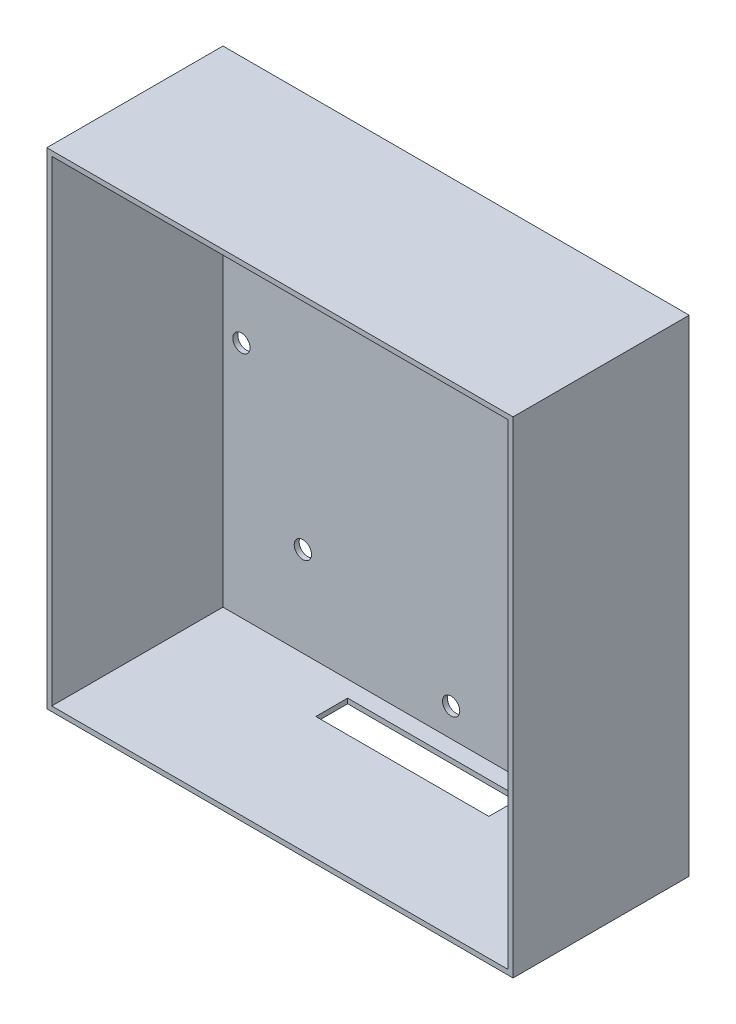
ISO-10303-21;
HEADER;
FILE_DESCRIPTION(('STEP AP214'),'2;1');
FILE_NAME('part.step','',(''),(''),'','','');
FILE_SCHEMA(('AUTOMOTIVE_DESIGN { 1 0 10303 214 1 1 1 1 }'));
ENDSEC;
DATA;
#1=APPLICATION_CONTEXT('core data for automotive mechanical design processes');
#2=APPLICATION_PROTOCOL_DEFINITION('international standard','automotive_design',2000,#1);
#3=PRODUCT_CONTEXT('',#1,'mechanical');
#4=PRODUCT('Part','Part','',(#3));
#5=PRODUCT_RELATED_PRODUCT_CATEGORY('part','',(#4));
#6=PRODUCT_DEFINITION_FORMATION('','',#4);
#7=PRODUCT_DEFINITION_CONTEXT('part definition',#1,'design');
#8=PRODUCT_DEFINITION('design','',#6,#7);
#9=PRODUCT_DEFINITION_SHAPE('','',#8);
#10=(LENGTH_UNIT() NAMED_UNIT(*) SI_UNIT(.MILLI.,.METRE.));
#11=(NAMED_UNIT(*) PLANE_ANGLE_UNIT() SI_UNIT($,.RADIAN.));
#12=(NAMED_UNIT(*) SI_UNIT($,.STERADIAN.) SOLID_ANGLE_UNIT());
#13=UNCERTAINTY_MEASURE_WITH_UNIT(LENGTH_MEASURE(1.E-05),#10,'distance_accuracy_value','');
#14=(GEOMETRIC_REPRESENTATION_CONTEXT(3) GLOBAL_UNCERTAINTY_ASSIGNED_CONTEXT((#13)) GLOBAL_UNIT_ASSIGNED_CONTEXT((#10,
#11,#12)) REPRESENTATION_CONTEXT('',''));
#15=CARTESIAN_POINT('',(0.,0.,0.));
#16=DIRECTION('',(0.,0.,1.));
#17=DIRECTION('',(1.,0.,0.));
#18=AXIS2_PLACEMENT_3D('',#15,#16,#17);
#19=CARTESIAN_POINT('',(0.,0.,35.7));
#20=DIRECTION('',(0.,0.,-1.));
#21=DIRECTION('',(-1.,0.,0.));
#22=AXIS2_PLACEMENT_3D('',#19,#20,#21);
#23=PLANE('',#22);
#24=DIRECTION('',(0.,-1.,0.));
#25=VECTOR('',#24,1.);
#26=CARTESIAN_POINT('',(0.,0.,35.7));
#27=LINE('',#26,#25);
#28=CARTESIAN_POINT('',(0.,98.5,35.7));
#29=VERTEX_POINT('',#28);
#30=CARTESIAN_POINT('',(0.,0.,35.7));
#31=VERTEX_POINT('',#30);
#32=EDGE_CURVE('E201',#29,#31,#27,.T.);
#33=ORIENTED_EDGE('',*,*,#32,.T.);
#34=DIRECTION('',(1.,0.,0.));
#35=VECTOR('',#34,1.);
#36=CARTESIAN_POINT('',(0.,0.,35.7));
#37=LINE('',#36,#35);
#38=CARTESIAN_POINT('',(94.5,0.,35.7));
#39=VERTEX_POINT('',#38);
#40=EDGE_CURVE('E204',#31,#39,#37,.T.);
#41=ORIENTED_EDGE('',*,*,#40,.T.);
#42=DIRECTION('',(0.,1.,0.));
#43=VECTOR('',#42,1.);
#44=CARTESIAN_POINT('',(94.5,0.,35.7));
#45=LINE('',#44,#43);
#46=CARTESIAN_POINT('',(94.5,98.5,35.7));
#47=VERTEX_POINT('',#46);
#48=EDGE_CURVE('E207',#39,#47,#45,.T.);
#49=ORIENTED_EDGE('',*,*,#48,.T.);
#50=DIRECTION('',(-1.,0.,0.));
#51=VECTOR('',#50,1.);
#52=CARTESIAN_POINT('',(0.,98.5,35.7));
#53=LINE('',#52,#51);
#54=EDGE_CURVE('E209',#47,#29,#53,.T.);
#55=ORIENTED_EDGE('',*,*,#54,.T.);
#56=EDGE_LOOP('',(#33,#41,#49,#55));
#57=FACE_BOUND('',#56,.T.);
#58=DIRECTION('',(0.,-1.,0.));
#59=VECTOR('',#58,1.);
#60=CARTESIAN_POINT('',(1.,0.,35.7));
#61=LINE('',#60,#59);
#62=CARTESIAN_POINT('',(1.,97.5,35.7));
#63=VERTEX_POINT('',#62);
#64=CARTESIAN_POINT('',(1.,1.,35.7));
#65=VERTEX_POINT('',#64);
#66=EDGE_CURVE('E193',#63,#65,#61,.T.);
#67=ORIENTED_EDGE('',*,*,#66,.F.);
#68=DIRECTION('',(-1.,0.,0.));
#69=VECTOR('',#68,1.);
#70=CARTESIAN_POINT('',(0.,97.5,35.7));
#71=LINE('',#70,#69);
#72=CARTESIAN_POINT('',(93.5,97.5,35.7));
#73=VERTEX_POINT('',#72);
#74=EDGE_CURVE('E183',#73,#63,#71,.T.);
#75=ORIENTED_EDGE('',*,*,#74,.F.);
#76=DIRECTION('',(0.,1.,0.));
#77=VECTOR('',#76,1.);
#78=CARTESIAN_POINT('',(93.5,0.,35.7));
#79=LINE('',#78,#77);
#80=CARTESIAN_POINT('',(93.5,1.,35.7));
#81=VERTEX_POINT('',#80);
#82=EDGE_CURVE('E197',#81,#73,#79,.T.);
#83=ORIENTED_EDGE('',*,*,#82,.F.);
#84=DIRECTION('',(1.,0.,0.));
#85=VECTOR('',#84,1.);
#86=CARTESIAN_POINT('',(0.,1.,35.7));
#87=LINE('',#86,#85);
#88=EDGE_CURVE('E195',#65,#81,#87,.T.);
#89=ORIENTED_EDGE('',*,*,#88,.F.);
#90=EDGE_LOOP('',(#67,#75,#83,#89));
#91=FACE_BOUND('',#90,.T.);
#92=ADVANCED_FACE('F41',(#57,#91),#23,.F.);
#93=CARTESIAN_POINT('',(0.,0.,35.7));
#94=DIRECTION('',(1.,0.,0.));
#95=DIRECTION('',(0.,0.,-1.));
#96=AXIS2_PLACEMENT_3D('',#93,#94,#95);
#97=PLANE('',#96);
#98=DIRECTION('',(0.,-1.,0.));
#99=VECTOR('',#98,1.);
#100=CARTESIAN_POINT('',(0.,0.,0.));
#101=LINE('',#100,#99);
#102=CARTESIAN_POINT('',(0.,98.5,0.));
#103=VERTEX_POINT('',#102);
#104=CARTESIAN_POINT('',(0.,0.,0.));
#105=VERTEX_POINT('',#104);
#106=EDGE_CURVE('E177',#103,#105,#101,.T.);
#107=ORIENTED_EDGE('',*,*,#106,.T.);
#108=DIRECTION('',(0.,0.,-1.));
#109=VECTOR('',#108,1.);
#110=CARTESIAN_POINT('',(0.,0.,35.7));
#111=LINE('',#110,#109);
#112=EDGE_CURVE('E11',#31,#105,#111,.T.);
#113=ORIENTED_EDGE('',*,*,#112,.F.);
#114=ORIENTED_EDGE('',*,*,#32,.F.);
#115=DIRECTION('',(0.,0.,-1.));
#116=VECTOR('',#115,1.);
#117=CARTESIAN_POINT('',(0.,98.5,35.7));
#118=LINE('',#117,#116);
#119=EDGE_CURVE('E211',#29,#103,#118,.T.);
#120=ORIENTED_EDGE('',*,*,#119,.T.);
#121=EDGE_LOOP('',(#107,#113,#114,#120));
#122=FACE_BOUND('',#121,.T.);
#123=ADVANCED_FACE('F43',(#122),#97,.F.);
#124=CARTESIAN_POINT('',(0.,0.,35.7));
#125=DIRECTION('',(0.,1.,0.));
#126=DIRECTION('',(0.,0.,1.));
#127=AXIS2_PLACEMENT_3D('',#124,#125,#126);
#128=PLANE('',#127);
#129=DIRECTION('',(1.,0.,0.));
#130=VECTOR('',#129,1.);
#131=CARTESIAN_POINT('',(29.6065660306334,0.,10.7813994724809));
#132=LINE('',#131,#130);
#133=CARTESIAN_POINT('',(29.6065660306334,0.,10.7813994724809));
#134=VERTEX_POINT('',#133);
#135=CARTESIAN_POINT('',(64.6833967902257,0.,10.7813994724809));
#136=VERTEX_POINT('',#135);
#137=EDGE_CURVE('E138',#134,#136,#132,.T.);
#138=ORIENTED_EDGE('',*,*,#137,.T.);
#139=DIRECTION('',(0.,0.,-1.));
#140=VECTOR('',#139,1.);
#141=CARTESIAN_POINT('',(64.6833967902257,0.,10.7813994724809));
#142=LINE('',#141,#140);
#143=CARTESIAN_POINT('',(64.6833967902257,0.,4.32975983869224));
#144=VERTEX_POINT('',#143);
#145=EDGE_CURVE('E132',#136,#144,#142,.T.);
#146=ORIENTED_EDGE('',*,*,#145,.T.);
#147=DIRECTION('',(-1.,0.,0.));
#148=VECTOR('',#147,1.);
#149=CARTESIAN_POINT('',(29.6065660306334,0.,4.32975983869224));
#150=LINE('',#149,#148);
#151=CARTESIAN_POINT('',(29.6065660306334,0.,4.32975983869224));
#152=VERTEX_POINT('',#151);
#153=EDGE_CURVE('E141',#144,#152,#150,.T.);
#154=ORIENTED_EDGE('',*,*,#153,.T.);
#155=DIRECTION('',(0.,0.,1.));
#156=VECTOR('',#155,1.);
#157=CARTESIAN_POINT('',(29.6065660306334,0.,10.7813994724809));
#158=LINE('',#157,#156);
#159=EDGE_CURVE('E56',#152,#134,#158,.T.);
#160=ORIENTED_EDGE('',*,*,#159,.T.);
#161=EDGE_LOOP('',(#138,#146,#154,#160));
#162=FACE_BOUND('',#161,.T.);
#163=DIRECTION('',(1.,0.,0.));
#164=VECTOR('',#163,1.);
#165=CARTESIAN_POINT('',(0.,0.,0.));
#166=LINE('',#165,#164);
#167=CARTESIAN_POINT('',(94.5,0.,0.));
#168=VERTEX_POINT('',#167);
#169=EDGE_CURVE('E214',#105,#168,#166,.T.);
#170=ORIENTED_EDGE('',*,*,#169,.T.);
#171=DIRECTION('',(0.,0.,-1.));
#172=VECTOR('',#171,1.);
#173=CARTESIAN_POINT('',(94.5,0.,35.7));
#174=LINE('',#173,#172);
#175=EDGE_CURVE('E49',#39,#168,#174,.T.);
#176=ORIENTED_EDGE('',*,*,#175,.F.);
#177=ORIENTED_EDGE('',*,*,#40,.F.);
#178=ORIENTED_EDGE('',*,*,#112,.T.);
#179=EDGE_LOOP('',(#170,#176,#177,#178));
#180=FACE_BOUND('',#179,.T.);
#181=ADVANCED_FACE('F145',(#162,#180),#128,.F.);
#182=CARTESIAN_POINT('',(94.5,0.,35.7));
#183=DIRECTION('',(-1.,0.,0.));
#184=DIRECTION('',(0.,0.,1.));
#185=AXIS2_PLACEMENT_3D('',#182,#183,#184);
#186=PLANE('',#185);
#187=DIRECTION('',(0.,1.,0.));
#188=VECTOR('',#187,1.);
#189=CARTESIAN_POINT('',(94.5,0.,0.));
#190=LINE('',#189,#188);
#191=CARTESIAN_POINT('',(94.5,98.5,0.));
#192=VERTEX_POINT('',#191);
#193=EDGE_CURVE('E216',#168,#192,#190,.T.);
#194=ORIENTED_EDGE('',*,*,#193,.T.);
#195=DIRECTION('',(0.,0.,-1.));
#196=VECTOR('',#195,1.);
#197=CARTESIAN_POINT('',(94.5,98.5,35.7));
#198=LINE('',#197,#196);
#199=EDGE_CURVE('E221',#47,#192,#198,.T.);
#200=ORIENTED_EDGE('',*,*,#199,.F.);
#201=ORIENTED_EDGE('',*,*,#48,.F.);
#202=ORIENTED_EDGE('',*,*,#175,.T.);
#203=EDGE_LOOP('',(#194,#200,#201,#202));
#204=FACE_BOUND('',#203,.T.);
#205=ADVANCED_FACE('F228',(#204),#186,.F.);
#206=CARTESIAN_POINT('',(0.,98.5,35.7));
#207=DIRECTION('',(0.,-1.,0.));
#208=DIRECTION('',(0.,0.,-1.));
#209=AXIS2_PLACEMENT_3D('',#206,#207,#208);
#210=PLANE('',#209);
#211=DIRECTION('',(-1.,0.,0.));
#212=VECTOR('',#211,1.);
#213=CARTESIAN_POINT('',(0.,98.5,0.));
#214=LINE('',#213,#212);
#215=EDGE_CURVE('E205',#192,#103,#214,.T.);
#216=ORIENTED_EDGE('',*,*,#215,.T.);
#217=ORIENTED_EDGE('',*,*,#119,.F.);
#218=ORIENTED_EDGE('',*,*,#54,.F.);
#219=ORIENTED_EDGE('',*,*,#199,.T.);
#220=EDGE_LOOP('',(#216,#217,#218,#219));
#221=FACE_BOUND('',#220,.T.);
#222=ADVANCED_FACE('F236',(#221),#210,.F.);
#223=CARTESIAN_POINT('',(0.,0.,0.));
#224=DIRECTION('',(0.,0.,-1.));
#225=DIRECTION('',(-1.,0.,0.));
#226=AXIS2_PLACEMENT_3D('',#223,#224,#225);
#227=PLANE('',#226);
#228=CARTESIAN_POINT('',(4.75000000000136,49.25,0.));
#229=DIRECTION('',(0.,0.,1.));
#230=DIRECTION('',(1.,0.,0.));
#231=AXIS2_PLACEMENT_3D('',#228,#229,#230);
#232=CIRCLE('',#231,1.75);
#233=CARTESIAN_POINT('',(6.50000000000137,49.25,0.));
#234=VERTEX_POINT('',#233);
#235=EDGE_CURVE('E161',#234,#234,#232,.T.);
#236=ORIENTED_EDGE('',*,*,#235,.T.);
#237=EDGE_LOOP('',(#236));
#238=FACE_BOUND('',#237,.T.);
#239=CARTESIAN_POINT('',(17.1979617995868,19.1979617995387,0.));
#240=DIRECTION('',(0.,0.,1.));
#241=DIRECTION('',(1.,0.,0.));
#242=AXIS2_PLACEMENT_3D('',#239,#240,#241);
#243=CIRCLE('',#242,1.74999999999999);
#244=CARTESIAN_POINT('',(18.9479617995868,19.1979617995387,0.));
#245=VERTEX_POINT('',#244);
#246=EDGE_CURVE('E513',#245,#245,#243,.T.);
#247=ORIENTED_EDGE('',*,*,#246,.T.);
#248=EDGE_LOOP('',(#247));
#249=FACE_BOUND('',#248,.T.);
#250=CARTESIAN_POINT('',(47.2500000000481,6.74999999995339,0.));
#251=DIRECTION('',(0.,0.,1.));
#252=DIRECTION('',(1.,0.,0.));
#253=AXIS2_PLACEMENT_3D('',#250,#251,#252);
#254=CIRCLE('',#253,1.75);
#255=CARTESIAN_POINT('',(49.0000000000481,6.74999999995339,0.));
#256=VERTEX_POINT('',#255);
#257=EDGE_CURVE('E521',#256,#256,#254,.T.);
#258=ORIENTED_EDGE('',*,*,#257,.T.);
#259=EDGE_LOOP('',(#258));
#260=FACE_BOUND('',#259,.T.);
#261=CARTESIAN_POINT('',(77.3020382005093,19.1979617995389,0.));
#262=DIRECTION('',(0.,0.,1.));
#263=DIRECTION('',(1.,0.,0.));
#264=AXIS2_PLACEMENT_3D('',#261,#262,#263);
#265=CIRCLE('',#264,1.75);
#266=CARTESIAN_POINT('',(79.0520382005093,19.1979617995389,0.));
#267=VERTEX_POINT('',#266);
#268=EDGE_CURVE('E527',#267,#267,#265,.T.);
#269=ORIENTED_EDGE('',*,*,#268,.T.);
#270=EDGE_LOOP('',(#269));
#271=FACE_BOUND('',#270,.T.);
#272=CARTESIAN_POINT('',(89.7500000000946,49.2500000000003,0.));
#273=DIRECTION('',(0.,0.,1.));
#274=DIRECTION('',(1.,0.,0.));
#275=AXIS2_PLACEMENT_3D('',#272,#273,#274);
#276=CIRCLE('',#275,1.75);
#277=CARTESIAN_POINT('',(91.5000000000946,49.2500000000003,0.));
#278=VERTEX_POINT('',#277);
#279=EDGE_CURVE('E533',#278,#278,#276,.T.);
#280=ORIENTED_EDGE('',*,*,#279,.T.);
#281=EDGE_LOOP('',(#280));
#282=FACE_BOUND('',#281,.T.);
#283=CARTESIAN_POINT('',(77.3020382005089,79.3020382004615,0.));
#284=DIRECTION('',(0.,0.,1.));
#285=DIRECTION('',(1.,0.,0.));
#286=AXIS2_PLACEMENT_3D('',#283,#284,#285);
#287=CIRCLE('',#286,1.75000000000002);
#288=CARTESIAN_POINT('',(79.052038200509,79.3020382004615,0.));
#289=VERTEX_POINT('',#288);
#290=EDGE_CURVE('E539',#289,#289,#287,.T.);
#291=ORIENTED_EDGE('',*,*,#290,.T.);
#292=EDGE_LOOP('',(#291));
#293=FACE_BOUND('',#292,.T.);
#294=CARTESIAN_POINT('',(47.2500000000475,91.7500000000466,0.));
#295=DIRECTION('',(0.,0.,1.));
#296=DIRECTION('',(1.,0.,0.));
#297=AXIS2_PLACEMENT_3D('',#294,#295,#296);
#298=CIRCLE('',#297,1.75);
#299=CARTESIAN_POINT('',(49.0000000000475,91.7500000000466,0.));
#300=VERTEX_POINT('',#299);
#301=EDGE_CURVE('E545',#300,#300,#298,.T.);
#302=ORIENTED_EDGE('',*,*,#301,.T.);
#303=EDGE_LOOP('',(#302));
#304=FACE_BOUND('',#303,.T.);
#305=CARTESIAN_POINT('',(17.1979617995864,79.3020382004609,0.));
#306=DIRECTION('',(0.,0.,1.));
#307=DIRECTION('',(1.,0.,0.));
#308=AXIS2_PLACEMENT_3D('',#305,#306,#307);
#309=CIRCLE('',#308,1.75);
#310=CARTESIAN_POINT('',(18.9479617995864,79.3020382004609,0.));
#311=VERTEX_POINT('',#310);
#312=EDGE_CURVE('E154',#311,#311,#309,.T.);
#313=ORIENTED_EDGE('',*,*,#312,.T.);
#314=EDGE_LOOP('',(#313));
#315=FACE_BOUND('',#314,.T.);
#316=ORIENTED_EDGE('',*,*,#106,.F.);
#317=ORIENTED_EDGE('',*,*,#215,.F.);
#318=ORIENTED_EDGE('',*,*,#193,.F.);
#319=ORIENTED_EDGE('',*,*,#169,.F.);
#320=EDGE_LOOP('',(#316,#317,#318,#319));
#321=FACE_BOUND('',#320,.T.);
#322=ADVANCED_FACE('F233',(#238,#249,#260,#271,#282,#293,#304,#315,#321),#227,.T.);
#323=CARTESIAN_POINT('',(1.,0.,35.7));
#324=DIRECTION('',(1.,0.,0.));
#325=DIRECTION('',(0.,0.,-1.));
#326=AXIS2_PLACEMENT_3D('',#323,#324,#325);
#327=PLANE('',#326);
#328=DIRECTION('',(0.,-1.,0.));
#329=VECTOR('',#328,1.);
#330=CARTESIAN_POINT('',(1.,0.,1.));
#331=LINE('',#330,#329);
#332=CARTESIAN_POINT('',(1.,97.5,1.));
#333=VERTEX_POINT('',#332);
#334=CARTESIAN_POINT('',(1.,1.,1.));
#335=VERTEX_POINT('',#334);
#336=EDGE_CURVE('E167',#333,#335,#331,.T.);
#337=ORIENTED_EDGE('',*,*,#336,.F.);
#338=DIRECTION('',(0.,0.,-1.));
#339=VECTOR('',#338,1.);
#340=CARTESIAN_POINT('',(1.,97.5,35.7));
#341=LINE('',#340,#339);
#342=EDGE_CURVE('E179',#63,#333,#341,.T.);
#343=ORIENTED_EDGE('',*,*,#342,.F.);
#344=ORIENTED_EDGE('',*,*,#66,.T.);
#345=DIRECTION('',(0.,0.,-1.));
#346=VECTOR('',#345,1.);
#347=CARTESIAN_POINT('',(1.,1.,35.7));
#348=LINE('',#347,#346);
#349=EDGE_CURVE('E174',#65,#335,#348,.T.);
#350=ORIENTED_EDGE('',*,*,#349,.T.);
#351=EDGE_LOOP('',(#337,#343,#344,#350));
#352=FACE_BOUND('',#351,.T.);
#353=ADVANCED_FACE('F259',(#352),#327,.T.);
#354=CARTESIAN_POINT('',(0.,1.,35.7));
#355=DIRECTION('',(0.,1.,0.));
#356=DIRECTION('',(0.,0.,1.));
#357=AXIS2_PLACEMENT_3D('',#354,#355,#356);
#358=PLANE('',#357);
#359=DIRECTION('',(0.,0.,-1.));
#360=VECTOR('',#359,1.);
#361=CARTESIAN_POINT('',(64.6833967902257,1.,10.7813994724809));
#362=LINE('',#361,#360);
#363=CARTESIAN_POINT('',(64.6833967902257,1.,10.7813994724809));
#364=VERTEX_POINT('',#363);
#365=CARTESIAN_POINT('',(64.6833967902257,1.,4.32975983869224));
#366=VERTEX_POINT('',#365);
#367=EDGE_CURVE('E64',#364,#366,#362,.T.);
#368=ORIENTED_EDGE('',*,*,#367,.F.);
#369=DIRECTION('',(1.,0.,0.));
#370=VECTOR('',#369,1.);
#371=CARTESIAN_POINT('',(29.6065660306334,1.,10.7813994724809));
#372=LINE('',#371,#370);
#373=CARTESIAN_POINT('',(29.6065660306334,1.,10.7813994724809));
#374=VERTEX_POINT('',#373);
#375=EDGE_CURVE('E148',#374,#364,#372,.T.);
#376=ORIENTED_EDGE('',*,*,#375,.F.);
#377=DIRECTION('',(0.,0.,1.));
#378=VECTOR('',#377,1.);
#379=CARTESIAN_POINT('',(29.6065660306334,1.,10.7813994724809));
#380=LINE('',#379,#378);
#381=CARTESIAN_POINT('',(29.6065660306334,1.,4.32975983869224));
#382=VERTEX_POINT('',#381);
#383=EDGE_CURVE('E151',#382,#374,#380,.T.);
#384=ORIENTED_EDGE('',*,*,#383,.F.);
#385=DIRECTION('',(-1.,0.,0.));
#386=VECTOR('',#385,1.);
#387=CARTESIAN_POINT('',(29.6065660306334,1.,4.32975983869224));
#388=LINE('',#387,#386);
#389=EDGE_CURVE('E160',#366,#382,#388,.T.);
#390=ORIENTED_EDGE('',*,*,#389,.F.);
#391=EDGE_LOOP('',(#368,#376,#384,#390));
#392=FACE_BOUND('',#391,.T.);
#393=DIRECTION('',(1.,0.,0.));
#394=VECTOR('',#393,1.);
#395=CARTESIAN_POINT('',(0.,1.,1.));
#396=LINE('',#395,#394);
#397=CARTESIAN_POINT('',(93.5,1.,1.));
#398=VERTEX_POINT('',#397);
#399=EDGE_CURVE('E173',#335,#398,#396,.T.);
#400=ORIENTED_EDGE('',*,*,#399,.F.);
#401=ORIENTED_EDGE('',*,*,#349,.F.);
#402=ORIENTED_EDGE('',*,*,#88,.T.);
#403=DIRECTION('',(0.,0.,-1.));
#404=VECTOR('',#403,1.);
#405=CARTESIAN_POINT('',(93.5,1.,35.7));
#406=LINE('',#405,#404);
#407=EDGE_CURVE('E178',#81,#398,#406,.T.);
#408=ORIENTED_EDGE('',*,*,#407,.T.);
#409=EDGE_LOOP('',(#400,#401,#402,#408));
#410=FACE_BOUND('',#409,.T.);
#411=ADVANCED_FACE('F278',(#392,#410),#358,.T.);
#412=CARTESIAN_POINT('',(93.5,0.,35.7));
#413=DIRECTION('',(-1.,0.,0.));
#414=DIRECTION('',(0.,0.,1.));
#415=AXIS2_PLACEMENT_3D('',#412,#413,#414);
#416=PLANE('',#415);
#417=DIRECTION('',(0.,1.,0.));
#418=VECTOR('',#417,1.);
#419=CARTESIAN_POINT('',(93.5,0.,1.));
#420=LINE('',#419,#418);
#421=CARTESIAN_POINT('',(93.5,97.5,1.));
#422=VERTEX_POINT('',#421);
#423=EDGE_CURVE('E185',#398,#422,#420,.T.);
#424=ORIENTED_EDGE('',*,*,#423,.F.);
#425=ORIENTED_EDGE('',*,*,#407,.F.);
#426=ORIENTED_EDGE('',*,*,#82,.T.);
#427=DIRECTION('',(0.,0.,-1.));
#428=VECTOR('',#427,1.);
#429=CARTESIAN_POINT('',(93.5,97.5,35.7));
#430=LINE('',#429,#428);
#431=EDGE_CURVE('E182',#73,#422,#430,.T.);
#432=ORIENTED_EDGE('',*,*,#431,.T.);
#433=EDGE_LOOP('',(#424,#425,#426,#432));
#434=FACE_BOUND('',#433,.T.);
#435=ADVANCED_FACE('F287',(#434),#416,.T.);
#436=CARTESIAN_POINT('',(0.,97.5,35.7));
#437=DIRECTION('',(0.,-1.,0.));
#438=DIRECTION('',(0.,0.,-1.));
#439=AXIS2_PLACEMENT_3D('',#436,#437,#438);
#440=PLANE('',#439);
#441=DIRECTION('',(-1.,0.,0.));
#442=VECTOR('',#441,1.);
#443=CARTESIAN_POINT('',(0.,97.5,1.));
#444=LINE('',#443,#442);
#445=EDGE_CURVE('E189',#422,#333,#444,.T.);
#446=ORIENTED_EDGE('',*,*,#445,.F.);
#447=ORIENTED_EDGE('',*,*,#431,.F.);
#448=ORIENTED_EDGE('',*,*,#74,.T.);
#449=ORIENTED_EDGE('',*,*,#342,.T.);
#450=EDGE_LOOP('',(#446,#447,#448,#449));
#451=FACE_BOUND('',#450,.T.);
#452=ADVANCED_FACE('F295',(#451),#440,.T.);
#453=CARTESIAN_POINT('',(0.,0.,1.));
#454=DIRECTION('',(0.,0.,-1.));
#455=DIRECTION('',(-1.,0.,0.));
#456=AXIS2_PLACEMENT_3D('',#453,#454,#455);
#457=PLANE('',#456);
#458=CARTESIAN_POINT('',(4.75000000000136,49.25,1.));
#459=DIRECTION('',(0.,0.,1.));
#460=DIRECTION('',(1.,0.,0.));
#461=AXIS2_PLACEMENT_3D('',#458,#459,#460);
#462=CIRCLE('',#461,1.75);
#463=CARTESIAN_POINT('',(6.50000000000137,49.25,1.));
#464=VERTEX_POINT('',#463);
#465=EDGE_CURVE('E508',#464,#464,#462,.T.);
#466=ORIENTED_EDGE('',*,*,#465,.F.);
#467=EDGE_LOOP('',(#466));
#468=FACE_BOUND('',#467,.T.);
#469=CARTESIAN_POINT('',(17.1979617995868,19.1979617995387,1.));
#470=DIRECTION('',(0.,0.,1.));
#471=DIRECTION('',(1.,0.,0.));
#472=AXIS2_PLACEMENT_3D('',#469,#470,#471);
#473=CIRCLE('',#472,1.74999999999999);
#474=CARTESIAN_POINT('',(18.9479617995868,19.1979617995387,1.));
#475=VERTEX_POINT('',#474);
#476=EDGE_CURVE('E509',#475,#475,#473,.T.);
#477=ORIENTED_EDGE('',*,*,#476,.F.);
#478=EDGE_LOOP('',(#477));
#479=FACE_BOUND('',#478,.T.);
#480=CARTESIAN_POINT('',(47.2500000000481,6.74999999995339,1.));
#481=DIRECTION('',(0.,0.,1.));
#482=DIRECTION('',(1.,0.,0.));
#483=AXIS2_PLACEMENT_3D('',#480,#481,#482);
#484=CIRCLE('',#483,1.75);
#485=CARTESIAN_POINT('',(49.0000000000481,6.74999999995339,1.));
#486=VERTEX_POINT('',#485);
#487=EDGE_CURVE('E518',#486,#486,#484,.T.);
#488=ORIENTED_EDGE('',*,*,#487,.F.);
#489=EDGE_LOOP('',(#488));
#490=FACE_BOUND('',#489,.T.);
#491=CARTESIAN_POINT('',(77.3020382005093,19.1979617995389,1.));
#492=DIRECTION('',(0.,0.,1.));
#493=DIRECTION('',(1.,0.,0.));
#494=AXIS2_PLACEMENT_3D('',#491,#492,#493);
#495=CIRCLE('',#494,1.75);
#496=CARTESIAN_POINT('',(79.0520382005093,19.1979617995389,1.));
#497=VERTEX_POINT('',#496);
#498=EDGE_CURVE('E524',#497,#497,#495,.T.);
#499=ORIENTED_EDGE('',*,*,#498,.F.);
#500=EDGE_LOOP('',(#499));
#501=FACE_BOUND('',#500,.T.);
#502=CARTESIAN_POINT('',(89.7500000000946,49.2500000000003,1.));
#503=DIRECTION('',(0.,0.,1.));
#504=DIRECTION('',(1.,0.,0.));
#505=AXIS2_PLACEMENT_3D('',#502,#503,#504);
#506=CIRCLE('',#505,1.75);
#507=CARTESIAN_POINT('',(91.5000000000946,49.2500000000003,1.));
#508=VERTEX_POINT('',#507);
#509=EDGE_CURVE('E530',#508,#508,#506,.T.);
#510=ORIENTED_EDGE('',*,*,#509,.F.);
#511=EDGE_LOOP('',(#510));
#512=FACE_BOUND('',#511,.T.);
#513=CARTESIAN_POINT('',(77.3020382005089,79.3020382004615,1.));
#514=DIRECTION('',(0.,0.,1.));
#515=DIRECTION('',(1.,0.,0.));
#516=AXIS2_PLACEMENT_3D('',#513,#514,#515);
#517=CIRCLE('',#516,1.75000000000002);
#518=CARTESIAN_POINT('',(79.052038200509,79.3020382004615,1.));
#519=VERTEX_POINT('',#518);
#520=EDGE_CURVE('E536',#519,#519,#517,.T.);
#521=ORIENTED_EDGE('',*,*,#520,.F.);
#522=EDGE_LOOP('',(#521));
#523=FACE_BOUND('',#522,.T.);
#524=CARTESIAN_POINT('',(47.2500000000475,91.7500000000466,1.));
#525=DIRECTION('',(0.,0.,1.));
#526=DIRECTION('',(1.,0.,0.));
#527=AXIS2_PLACEMENT_3D('',#524,#525,#526);
#528=CIRCLE('',#527,1.75);
#529=CARTESIAN_POINT('',(49.0000000000475,91.7500000000466,1.));
#530=VERTEX_POINT('',#529);
#531=EDGE_CURVE('E542',#530,#530,#528,.T.);
#532=ORIENTED_EDGE('',*,*,#531,.F.);
#533=EDGE_LOOP('',(#532));
#534=FACE_BOUND('',#533,.T.);
#535=CARTESIAN_POINT('',(17.1979617995864,79.3020382004609,1.));
#536=DIRECTION('',(0.,0.,1.));
#537=DIRECTION('',(1.,0.,0.));
#538=AXIS2_PLACEMENT_3D('',#535,#536,#537);
#539=CIRCLE('',#538,1.75);
#540=CARTESIAN_POINT('',(18.9479617995864,79.3020382004609,1.));
#541=VERTEX_POINT('',#540);
#542=EDGE_CURVE('E547',#541,#541,#539,.T.);
#543=ORIENTED_EDGE('',*,*,#542,.F.);
#544=EDGE_LOOP('',(#543));
#545=FACE_BOUND('',#544,.T.);
#546=ORIENTED_EDGE('',*,*,#336,.T.);
#547=ORIENTED_EDGE('',*,*,#399,.T.);
#548=ORIENTED_EDGE('',*,*,#423,.T.);
#549=ORIENTED_EDGE('',*,*,#445,.T.);
#550=EDGE_LOOP('',(#546,#547,#548,#549));
#551=FACE_BOUND('',#550,.T.);
#552=ADVANCED_FACE('F255',(#468,#479,#490,#501,#512,#523,#534,#545,#551),#457,.F.);
#553=CARTESIAN_POINT('',(64.6833967902257,0.,10.7813994724809));
#554=DIRECTION('',(1.,0.,0.));
#555=DIRECTION('',(0.,0.,-1.));
#556=AXIS2_PLACEMENT_3D('',#553,#554,#555);
#557=PLANE('',#556);
#558=ORIENTED_EDGE('',*,*,#367,.T.);
#559=DIRECTION('',(0.,1.,0.));
#560=VECTOR('',#559,1.);
#561=CARTESIAN_POINT('',(64.6833967902257,0.,4.32975983869224));
#562=LINE('',#561,#560);
#563=EDGE_CURVE('E128',#144,#366,#562,.T.);
#564=ORIENTED_EDGE('',*,*,#563,.F.);
#565=ORIENTED_EDGE('',*,*,#145,.F.);
#566=DIRECTION('',(0.,1.,0.));
#567=VECTOR('',#566,1.);
#568=CARTESIAN_POINT('',(64.6833967902257,0.,10.7813994724809));
#569=LINE('',#568,#567);
#570=EDGE_CURVE('E165',#136,#364,#569,.T.);
#571=ORIENTED_EDGE('',*,*,#570,.T.);
#572=EDGE_LOOP('',(#558,#564,#565,#571));
#573=FACE_BOUND('',#572,.T.);
#574=ADVANCED_FACE('F130',(#573),#557,.F.);
#575=CARTESIAN_POINT('',(29.6065660306334,0.,10.7813994724809));
#576=DIRECTION('',(0.,0.,1.));
#577=DIRECTION('',(1.,0.,0.));
#578=AXIS2_PLACEMENT_3D('',#575,#576,#577);
#579=PLANE('',#578);
#580=ORIENTED_EDGE('',*,*,#375,.T.);
#581=ORIENTED_EDGE('',*,*,#570,.F.);
#582=ORIENTED_EDGE('',*,*,#137,.F.);
#583=DIRECTION('',(0.,1.,0.));
#584=VECTOR('',#583,1.);
#585=CARTESIAN_POINT('',(29.6065660306334,0.,10.7813994724809));
#586=LINE('',#585,#584);
#587=EDGE_CURVE('E168',#134,#374,#586,.T.);
#588=ORIENTED_EDGE('',*,*,#587,.T.);
#589=EDGE_LOOP('',(#580,#581,#582,#588));
#590=FACE_BOUND('',#589,.T.);
#591=ADVANCED_FACE('F314',(#590),#579,.F.);
#592=CARTESIAN_POINT('',(29.6065660306334,0.,10.7813994724809));
#593=DIRECTION('',(-1.,0.,0.));
#594=DIRECTION('',(0.,0.,1.));
#595=AXIS2_PLACEMENT_3D('',#592,#593,#594);
#596=PLANE('',#595);
#597=ORIENTED_EDGE('',*,*,#383,.T.);
#598=ORIENTED_EDGE('',*,*,#587,.F.);
#599=ORIENTED_EDGE('',*,*,#159,.F.);
#600=DIRECTION('',(0.,1.,0.));
#601=VECTOR('',#600,1.);
#602=CARTESIAN_POINT('',(29.6065660306334,0.,4.32975983869224));
#603=LINE('',#602,#601);
#604=EDGE_CURVE('E137',#152,#382,#603,.T.);
#605=ORIENTED_EDGE('',*,*,#604,.T.);
#606=EDGE_LOOP('',(#597,#598,#599,#605));
#607=FACE_BOUND('',#606,.T.);
#608=ADVANCED_FACE('F321',(#607),#596,.F.);
#609=CARTESIAN_POINT('',(29.6065660306334,0.,4.32975983869224));
#610=DIRECTION('',(0.,0.,-1.));
#611=DIRECTION('',(-1.,0.,0.));
#612=AXIS2_PLACEMENT_3D('',#609,#610,#611);
#613=PLANE('',#612);
#614=ORIENTED_EDGE('',*,*,#389,.T.);
#615=ORIENTED_EDGE('',*,*,#604,.F.);
#616=ORIENTED_EDGE('',*,*,#153,.F.);
#617=ORIENTED_EDGE('',*,*,#563,.T.);
#618=EDGE_LOOP('',(#614,#615,#616,#617));
#619=FACE_BOUND('',#618,.T.);
#620=ADVANCED_FACE('F142',(#619),#613,.F.);
#621=CARTESIAN_POINT('',(17.1979617995864,79.3020382004609,0.));
#622=DIRECTION('',(0.,0.,1.));
#623=DIRECTION('',(1.,0.,0.));
#624=AXIS2_PLACEMENT_3D('',#621,#622,#623);
#625=CYLINDRICAL_SURFACE('',#624,1.75);
#626=ORIENTED_EDGE('',*,*,#312,.F.);
#627=EDGE_LOOP('',(#626));
#628=FACE_BOUND('',#627,.T.);
#629=ORIENTED_EDGE('',*,*,#542,.T.);
#630=EDGE_LOOP('',(#629));
#631=FACE_BOUND('',#630,.T.);
#632=ADVANCED_FACE('F334',(#628,#631),#625,.F.);
#633=CARTESIAN_POINT('',(47.2500000000475,91.7500000000466,0.));
#634=DIRECTION('',(0.,0.,1.));
#635=DIRECTION('',(1.,0.,0.));
#636=AXIS2_PLACEMENT_3D('',#633,#634,#635);
#637=CYLINDRICAL_SURFACE('',#636,1.75);
#638=ORIENTED_EDGE('',*,*,#301,.F.);
#639=EDGE_LOOP('',(#638));
#640=FACE_BOUND('',#639,.T.);
#641=ORIENTED_EDGE('',*,*,#531,.T.);
#642=EDGE_LOOP('',(#641));
#643=FACE_BOUND('',#642,.T.);
#644=ADVANCED_FACE('F340',(#640,#643),#637,.F.);
#645=CARTESIAN_POINT('',(77.3020382005089,79.3020382004615,0.));
#646=DIRECTION('',(0.,0.,1.));
#647=DIRECTION('',(1.,0.,0.));
#648=AXIS2_PLACEMENT_3D('',#645,#646,#647);
#649=CYLINDRICAL_SURFACE('',#648,1.75000000000002);
#650=ORIENTED_EDGE('',*,*,#290,.F.);
#651=EDGE_LOOP('',(#650));
#652=FACE_BOUND('',#651,.T.);
#653=ORIENTED_EDGE('',*,*,#520,.T.);
#654=EDGE_LOOP('',(#653));
#655=FACE_BOUND('',#654,.T.);
#656=ADVANCED_FACE('F348',(#652,#655),#649,.F.);
#657=CARTESIAN_POINT('',(89.7500000000946,49.2500000000003,0.));
#658=DIRECTION('',(0.,0.,1.));
#659=DIRECTION('',(1.,0.,0.));
#660=AXIS2_PLACEMENT_3D('',#657,#658,#659);
#661=CYLINDRICAL_SURFACE('',#660,1.75);
#662=ORIENTED_EDGE('',*,*,#279,.F.);
#663=EDGE_LOOP('',(#662));
#664=FACE_BOUND('',#663,.T.);
#665=ORIENTED_EDGE('',*,*,#509,.T.);
#666=EDGE_LOOP('',(#665));
#667=FACE_BOUND('',#666,.T.);
#668=ADVANCED_FACE('F356',(#664,#667),#661,.F.);
#669=CARTESIAN_POINT('',(77.3020382005093,19.1979617995389,0.));
#670=DIRECTION('',(0.,0.,1.));
#671=DIRECTION('',(1.,0.,0.));
#672=AXIS2_PLACEMENT_3D('',#669,#670,#671);
#673=CYLINDRICAL_SURFACE('',#672,1.75);
#674=ORIENTED_EDGE('',*,*,#268,.F.);
#675=EDGE_LOOP('',(#674));
#676=FACE_BOUND('',#675,.T.);
#677=ORIENTED_EDGE('',*,*,#498,.T.);
#678=EDGE_LOOP('',(#677));
#679=FACE_BOUND('',#678,.T.);
#680=ADVANCED_FACE('F364',(#676,#679),#673,.F.);
#681=CARTESIAN_POINT('',(47.2500000000481,6.74999999995339,0.));
#682=DIRECTION('',(0.,0.,1.));
#683=DIRECTION('',(1.,0.,0.));
#684=AXIS2_PLACEMENT_3D('',#681,#682,#683);
#685=CYLINDRICAL_SURFACE('',#684,1.75);
#686=ORIENTED_EDGE('',*,*,#257,.F.);
#687=EDGE_LOOP('',(#686));
#688=FACE_BOUND('',#687,.T.);
#689=ORIENTED_EDGE('',*,*,#487,.T.);
#690=EDGE_LOOP('',(#689));
#691=FACE_BOUND('',#690,.T.);
#692=ADVANCED_FACE('F372',(#688,#691),#685,.F.);
#693=CARTESIAN_POINT('',(17.1979617995868,19.1979617995387,0.));
#694=DIRECTION('',(0.,0.,1.));
#695=DIRECTION('',(1.,0.,0.));
#696=AXIS2_PLACEMENT_3D('',#693,#694,#695);
#697=CYLINDRICAL_SURFACE('',#696,1.74999999999999);
#698=ORIENTED_EDGE('',*,*,#246,.F.);
#699=EDGE_LOOP('',(#698));
#700=FACE_BOUND('',#699,.T.);
#701=ORIENTED_EDGE('',*,*,#476,.T.);
#702=EDGE_LOOP('',(#701));
#703=FACE_BOUND('',#702,.T.);
#704=ADVANCED_FACE('F380',(#700,#703),#697,.F.);
#705=CARTESIAN_POINT('',(4.75000000000136,49.25,0.));
#706=DIRECTION('',(0.,0.,1.));
#707=DIRECTION('',(1.,0.,0.));
#708=AXIS2_PLACEMENT_3D('',#705,#706,#707);
#709=CYLINDRICAL_SURFACE('',#708,1.75);
#710=ORIENTED_EDGE('',*,*,#235,.F.);
#711=EDGE_LOOP('',(#710));
#712=FACE_BOUND('',#711,.T.);
#713=ORIENTED_EDGE('',*,*,#465,.T.);
#714=EDGE_LOOP('',(#713));
#715=FACE_BOUND('',#714,.T.);
#716=ADVANCED_FACE('F388',(#712,#715),#709,.F.);
#717=CLOSED_SHELL('',(#92,#123,#181,#205,#222,#322,#353,#411,#435,#452,#552,#574,#591,#608,#620,
#632,#644,#656,#668,#680,#692,#704,#716));
#718=MANIFOLD_SOLID_BREP('B2',#717);
#719=ADVANCED_BREP_SHAPE_REPRESENTATION('',(#18,#718),#14);
#720=SHAPE_DEFINITION_REPRESENTATION(#9,#719);
ENDSEC;
END-ISO-10303-21;
